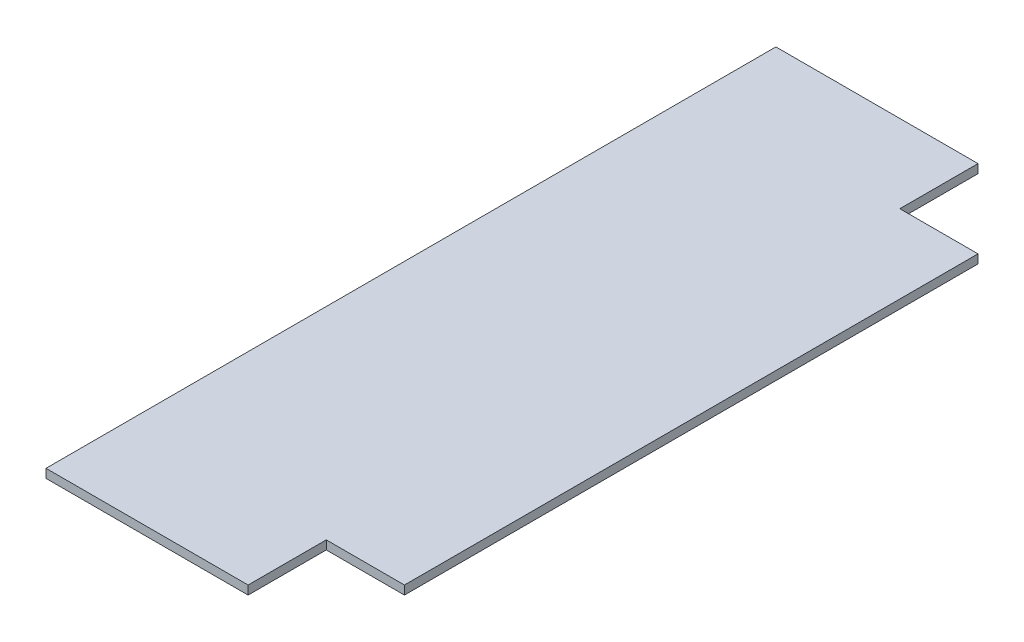
ISO-10303-21;
HEADER;
FILE_DESCRIPTION(('STEP AP214'),'2;1');
FILE_NAME('part.step','',(''),(''),'','','');
FILE_SCHEMA(('AUTOMOTIVE_DESIGN { 1 0 10303 214 1 1 1 1 }'));
ENDSEC;
DATA;
#1=APPLICATION_CONTEXT('core data for automotive mechanical design processes');
#2=APPLICATION_PROTOCOL_DEFINITION('international standard','automotive_design',2000,#1);
#3=PRODUCT_CONTEXT('',#1,'mechanical');
#4=PRODUCT('Part','Part','',(#3));
#5=PRODUCT_RELATED_PRODUCT_CATEGORY('part','',(#4));
#6=PRODUCT_DEFINITION_FORMATION('','',#4);
#7=PRODUCT_DEFINITION_CONTEXT('part definition',#1,'design');
#8=PRODUCT_DEFINITION('design','',#6,#7);
#9=PRODUCT_DEFINITION_SHAPE('','',#8);
#10=(LENGTH_UNIT() NAMED_UNIT(*) SI_UNIT(.MILLI.,.METRE.));
#11=(NAMED_UNIT(*) PLANE_ANGLE_UNIT() SI_UNIT($,.RADIAN.));
#12=(NAMED_UNIT(*) SI_UNIT($,.STERADIAN.) SOLID_ANGLE_UNIT());
#13=UNCERTAINTY_MEASURE_WITH_UNIT(LENGTH_MEASURE(1.E-05),#10,'distance_accuracy_value','');
#14=(GEOMETRIC_REPRESENTATION_CONTEXT(3) GLOBAL_UNCERTAINTY_ASSIGNED_CONTEXT((#13)) GLOBAL_UNIT_ASSIGNED_CONTEXT((#10,
#11,#12)) REPRESENTATION_CONTEXT('',''));
#15=CARTESIAN_POINT('',(0.,0.,0.));
#16=DIRECTION('',(0.,0.,1.));
#17=DIRECTION('',(1.,0.,0.));
#18=AXIS2_PLACEMENT_3D('',#15,#16,#17);
#19=CARTESIAN_POINT('',(0.,4.7625,0.));
#20=DIRECTION('',(1.,0.,0.));
#21=DIRECTION('',(0.,0.,-1.));
#22=AXIS2_PLACEMENT_3D('',#19,#20,#21);
#23=PLANE('',#22);
#24=DIRECTION('',(0.,0.,1.));
#25=VECTOR('',#24,1.);
#26=CARTESIAN_POINT('',(0.,0.,0.));
#27=LINE('',#26,#25);
#28=CARTESIAN_POINT('',(0.,0.,0.));
#29=VERTEX_POINT('',#28);
#30=CARTESIAN_POINT('',(0.,0.,396.875));
#31=VERTEX_POINT('',#30);
#32=EDGE_CURVE('E124',#29,#31,#27,.T.);
#33=ORIENTED_EDGE('',*,*,#32,.T.);
#34=DIRECTION('',(0.,-1.,0.));
#35=VECTOR('',#34,1.);
#36=CARTESIAN_POINT('',(0.,4.7625,396.875));
#37=LINE('',#36,#35);
#38=CARTESIAN_POINT('',(0.,4.7625,396.875));
#39=VERTEX_POINT('',#38);
#40=EDGE_CURVE('E11',#39,#31,#37,.T.);
#41=ORIENTED_EDGE('',*,*,#40,.F.);
#42=DIRECTION('',(0.,0.,1.));
#43=VECTOR('',#42,1.);
#44=CARTESIAN_POINT('',(0.,4.7625,0.));
#45=LINE('',#44,#43);
#46=CARTESIAN_POINT('',(0.,4.7625,0.));
#47=VERTEX_POINT('',#46);
#48=EDGE_CURVE('E125',#47,#39,#45,.T.);
#49=ORIENTED_EDGE('',*,*,#48,.F.);
#50=DIRECTION('',(0.,-1.,0.));
#51=VECTOR('',#50,1.);
#52=CARTESIAN_POINT('',(0.,4.7625,0.));
#53=LINE('',#52,#51);
#54=EDGE_CURVE('E46',#47,#29,#53,.T.);
#55=ORIENTED_EDGE('',*,*,#54,.T.);
#56=EDGE_LOOP('',(#33,#41,#49,#55));
#57=FACE_BOUND('',#56,.T.);
#58=ADVANCED_FACE('F39',(#57),#23,.F.);
#59=CARTESIAN_POINT('',(0.,4.7625,396.875));
#60=DIRECTION('',(0.,0.,-1.));
#61=DIRECTION('',(-1.,0.,0.));
#62=AXIS2_PLACEMENT_3D('',#59,#60,#61);
#63=PLANE('',#62);
#64=DIRECTION('',(1.,0.,0.));
#65=VECTOR('',#64,1.);
#66=CARTESIAN_POINT('',(0.,0.,396.875));
#67=LINE('',#66,#65);
#68=CARTESIAN_POINT('',(109.9,0.,396.875));
#69=VERTEX_POINT('',#68);
#70=EDGE_CURVE('E132',#31,#69,#67,.T.);
#71=ORIENTED_EDGE('',*,*,#70,.T.);
#72=DIRECTION('',(0.,1.,0.));
#73=VECTOR('',#72,1.);
#74=CARTESIAN_POINT('',(109.9,0.,396.875));
#75=LINE('',#74,#73);
#76=CARTESIAN_POINT('',(109.9,4.7625,396.875));
#77=VERTEX_POINT('',#76);
#78=EDGE_CURVE('E149',#69,#77,#75,.T.);
#79=ORIENTED_EDGE('',*,*,#78,.T.);
#80=DIRECTION('',(1.,0.,0.));
#81=VECTOR('',#80,1.);
#82=CARTESIAN_POINT('',(0.,4.7625,396.875));
#83=LINE('',#82,#81);
#84=EDGE_CURVE('E129',#39,#77,#83,.T.);
#85=ORIENTED_EDGE('',*,*,#84,.F.);
#86=ORIENTED_EDGE('',*,*,#40,.T.);
#87=EDGE_LOOP('',(#71,#79,#85,#86));
#88=FACE_BOUND('',#87,.T.);
#89=ADVANCED_FACE('F148',(#88),#63,.F.);
#90=CARTESIAN_POINT('',(152.4,4.7625,0.));
#91=DIRECTION('',(-1.,0.,0.));
#92=DIRECTION('',(0.,0.,1.));
#93=AXIS2_PLACEMENT_3D('',#90,#91,#92);
#94=PLANE('',#93);
#95=DIRECTION('',(0.,0.,-1.));
#96=VECTOR('',#95,1.);
#97=CARTESIAN_POINT('',(152.4,0.,0.));
#98=LINE('',#97,#96);
#99=CARTESIAN_POINT('',(152.4,0.,354.375));
#100=VERTEX_POINT('',#99);
#101=CARTESIAN_POINT('',(152.4,0.,42.5));
#102=VERTEX_POINT('',#101);
#103=EDGE_CURVE('E126',#100,#102,#98,.T.);
#104=ORIENTED_EDGE('',*,*,#103,.T.);
#105=DIRECTION('',(0.,1.,0.));
#106=VECTOR('',#105,1.);
#107=CARTESIAN_POINT('',(152.4,0.,42.5));
#108=LINE('',#107,#106);
#109=CARTESIAN_POINT('',(152.4,4.7625,42.5));
#110=VERTEX_POINT('',#109);
#111=EDGE_CURVE('E144',#102,#110,#108,.T.);
#112=ORIENTED_EDGE('',*,*,#111,.T.);
#113=DIRECTION('',(0.,0.,-1.));
#114=VECTOR('',#113,1.);
#115=CARTESIAN_POINT('',(152.4,4.7625,0.));
#116=LINE('',#115,#114);
#117=CARTESIAN_POINT('',(152.4,4.7625,354.375));
#118=VERTEX_POINT('',#117);
#119=EDGE_CURVE('E137',#118,#110,#116,.T.);
#120=ORIENTED_EDGE('',*,*,#119,.F.);
#121=DIRECTION('',(0.,1.,0.));
#122=VECTOR('',#121,1.);
#123=CARTESIAN_POINT('',(152.4,0.,354.375));
#124=LINE('',#123,#122);
#125=EDGE_CURVE('E155',#100,#118,#124,.T.);
#126=ORIENTED_EDGE('',*,*,#125,.F.);
#127=EDGE_LOOP('',(#104,#112,#120,#126));
#128=FACE_BOUND('',#127,.T.);
#129=ADVANCED_FACE('F172',(#128),#94,.F.);
#130=CARTESIAN_POINT('',(0.,4.7625,0.));
#131=DIRECTION('',(0.,0.,1.));
#132=DIRECTION('',(1.,0.,0.));
#133=AXIS2_PLACEMENT_3D('',#130,#131,#132);
#134=PLANE('',#133);
#135=DIRECTION('',(-1.,0.,0.));
#136=VECTOR('',#135,1.);
#137=CARTESIAN_POINT('',(0.,4.7625,0.));
#138=LINE('',#137,#136);
#139=CARTESIAN_POINT('',(109.9,4.7625,0.));
#140=VERTEX_POINT('',#139);
#141=EDGE_CURVE('E119',#140,#47,#138,.T.);
#142=ORIENTED_EDGE('',*,*,#141,.F.);
#143=DIRECTION('',(0.,1.,0.));
#144=VECTOR('',#143,1.);
#145=CARTESIAN_POINT('',(109.9,0.,0.));
#146=LINE('',#145,#144);
#147=CARTESIAN_POINT('',(109.9,0.,0.));
#148=VERTEX_POINT('',#147);
#149=EDGE_CURVE('E106',#148,#140,#146,.T.);
#150=ORIENTED_EDGE('',*,*,#149,.F.);
#151=DIRECTION('',(-1.,0.,0.));
#152=VECTOR('',#151,1.);
#153=CARTESIAN_POINT('',(0.,0.,0.));
#154=LINE('',#153,#152);
#155=EDGE_CURVE('E117',#148,#29,#154,.T.);
#156=ORIENTED_EDGE('',*,*,#155,.T.);
#157=ORIENTED_EDGE('',*,*,#54,.F.);
#158=EDGE_LOOP('',(#142,#150,#156,#157));
#159=FACE_BOUND('',#158,.T.);
#160=ADVANCED_FACE('F115',(#159),#134,.F.);
#161=CARTESIAN_POINT('',(0.,4.7625,0.));
#162=DIRECTION('',(0.,1.,0.));
#163=DIRECTION('',(0.,0.,1.));
#164=AXIS2_PLACEMENT_3D('',#161,#162,#163);
#165=PLANE('',#164);
#166=DIRECTION('',(1.,0.,0.));
#167=VECTOR('',#166,1.);
#168=CARTESIAN_POINT('',(152.4,4.7625,42.5));
#169=LINE('',#168,#167);
#170=CARTESIAN_POINT('',(109.9,4.7625,42.5));
#171=VERTEX_POINT('',#170);
#172=EDGE_CURVE('E111',#171,#110,#169,.T.);
#173=ORIENTED_EDGE('',*,*,#172,.F.);
#174=DIRECTION('',(0.,0.,1.));
#175=VECTOR('',#174,1.);
#176=CARTESIAN_POINT('',(109.9,4.7625,0.));
#177=LINE('',#176,#175);
#178=EDGE_CURVE('E199',#140,#171,#177,.T.);
#179=ORIENTED_EDGE('',*,*,#178,.F.);
#180=ORIENTED_EDGE('',*,*,#141,.T.);
#181=ORIENTED_EDGE('',*,*,#48,.T.);
#182=ORIENTED_EDGE('',*,*,#84,.T.);
#183=DIRECTION('',(0.,0.,1.));
#184=VECTOR('',#183,1.);
#185=CARTESIAN_POINT('',(109.9,4.7625,396.875));
#186=LINE('',#185,#184);
#187=CARTESIAN_POINT('',(109.9,4.7625,354.375));
#188=VERTEX_POINT('',#187);
#189=EDGE_CURVE('E157',#188,#77,#186,.T.);
#190=ORIENTED_EDGE('',*,*,#189,.F.);
#191=DIRECTION('',(-1.,0.,0.));
#192=VECTOR('',#191,1.);
#193=CARTESIAN_POINT('',(152.4,4.7625,354.375));
#194=LINE('',#193,#192);
#195=EDGE_CURVE('E162',#118,#188,#194,.T.);
#196=ORIENTED_EDGE('',*,*,#195,.F.);
#197=ORIENTED_EDGE('',*,*,#119,.T.);
#198=EDGE_LOOP('',(#173,#179,#180,#181,#182,#190,#196,#197));
#199=FACE_BOUND('',#198,.T.);
#200=ADVANCED_FACE('F166',(#199),#165,.T.);
#201=CARTESIAN_POINT('',(0.,0.,0.));
#202=DIRECTION('',(0.,1.,0.));
#203=DIRECTION('',(0.,0.,1.));
#204=AXIS2_PLACEMENT_3D('',#201,#202,#203);
#205=PLANE('',#204);
#206=DIRECTION('',(0.,0.,1.));
#207=VECTOR('',#206,1.);
#208=CARTESIAN_POINT('',(109.9,0.,0.));
#209=LINE('',#208,#207);
#210=CARTESIAN_POINT('',(109.9,0.,42.5));
#211=VERTEX_POINT('',#210);
#212=EDGE_CURVE('E102',#148,#211,#209,.T.);
#213=ORIENTED_EDGE('',*,*,#212,.T.);
#214=DIRECTION('',(1.,0.,0.));
#215=VECTOR('',#214,1.);
#216=CARTESIAN_POINT('',(152.4,0.,42.5));
#217=LINE('',#216,#215);
#218=EDGE_CURVE('E53',#211,#102,#217,.T.);
#219=ORIENTED_EDGE('',*,*,#218,.T.);
#220=ORIENTED_EDGE('',*,*,#103,.F.);
#221=DIRECTION('',(-1.,0.,0.));
#222=VECTOR('',#221,1.);
#223=CARTESIAN_POINT('',(152.4,0.,354.375));
#224=LINE('',#223,#222);
#225=CARTESIAN_POINT('',(109.9,0.,354.375));
#226=VERTEX_POINT('',#225);
#227=EDGE_CURVE('E154',#100,#226,#224,.T.);
#228=ORIENTED_EDGE('',*,*,#227,.T.);
#229=DIRECTION('',(0.,0.,1.));
#230=VECTOR('',#229,1.);
#231=CARTESIAN_POINT('',(109.9,0.,396.875));
#232=LINE('',#231,#230);
#233=EDGE_CURVE('E61',#226,#69,#232,.T.);
#234=ORIENTED_EDGE('',*,*,#233,.T.);
#235=ORIENTED_EDGE('',*,*,#70,.F.);
#236=ORIENTED_EDGE('',*,*,#32,.F.);
#237=ORIENTED_EDGE('',*,*,#155,.F.);
#238=EDGE_LOOP('',(#213,#219,#220,#228,#234,#235,#236,#237));
#239=FACE_BOUND('',#238,.T.);
#240=ADVANCED_FACE('F122',(#239),#205,.F.);
#241=CARTESIAN_POINT('',(109.9,0.,396.875));
#242=DIRECTION('',(-1.,0.,0.));
#243=DIRECTION('',(0.,0.,1.));
#244=AXIS2_PLACEMENT_3D('',#241,#242,#243);
#245=PLANE('',#244);
#246=ORIENTED_EDGE('',*,*,#189,.T.);
#247=ORIENTED_EDGE('',*,*,#78,.F.);
#248=ORIENTED_EDGE('',*,*,#233,.F.);
#249=DIRECTION('',(0.,1.,0.));
#250=VECTOR('',#249,1.);
#251=CARTESIAN_POINT('',(109.9,0.,354.375));
#252=LINE('',#251,#250);
#253=EDGE_CURVE('E159',#226,#188,#252,.T.);
#254=ORIENTED_EDGE('',*,*,#253,.T.);
#255=EDGE_LOOP('',(#246,#247,#248,#254));
#256=FACE_BOUND('',#255,.T.);
#257=ADVANCED_FACE('F183',(#256),#245,.F.);
#258=CARTESIAN_POINT('',(152.4,0.,354.375));
#259=DIRECTION('',(0.,0.,-1.));
#260=DIRECTION('',(-1.,0.,0.));
#261=AXIS2_PLACEMENT_3D('',#258,#259,#260);
#262=PLANE('',#261);
#263=ORIENTED_EDGE('',*,*,#195,.T.);
#264=ORIENTED_EDGE('',*,*,#253,.F.);
#265=ORIENTED_EDGE('',*,*,#227,.F.);
#266=ORIENTED_EDGE('',*,*,#125,.T.);
#267=EDGE_LOOP('',(#263,#264,#265,#266));
#268=FACE_BOUND('',#267,.T.);
#269=ADVANCED_FACE('F188',(#268),#262,.F.);
#270=CARTESIAN_POINT('',(152.4,0.,42.5));
#271=DIRECTION('',(0.,0.,1.));
#272=DIRECTION('',(1.,0.,0.));
#273=AXIS2_PLACEMENT_3D('',#270,#271,#272);
#274=PLANE('',#273);
#275=ORIENTED_EDGE('',*,*,#172,.T.);
#276=ORIENTED_EDGE('',*,*,#111,.F.);
#277=ORIENTED_EDGE('',*,*,#218,.F.);
#278=DIRECTION('',(0.,1.,0.));
#279=VECTOR('',#278,1.);
#280=CARTESIAN_POINT('',(109.9,0.,42.5));
#281=LINE('',#280,#279);
#282=EDGE_CURVE('E108',#211,#171,#281,.T.);
#283=ORIENTED_EDGE('',*,*,#282,.T.);
#284=EDGE_LOOP('',(#275,#276,#277,#283));
#285=FACE_BOUND('',#284,.T.);
#286=ADVANCED_FACE('F191',(#285),#274,.F.);
#287=CARTESIAN_POINT('',(109.9,0.,0.));
#288=DIRECTION('',(-1.,0.,0.));
#289=DIRECTION('',(0.,0.,1.));
#290=AXIS2_PLACEMENT_3D('',#287,#288,#289);
#291=PLANE('',#290);
#292=ORIENTED_EDGE('',*,*,#178,.T.);
#293=ORIENTED_EDGE('',*,*,#282,.F.);
#294=ORIENTED_EDGE('',*,*,#212,.F.);
#295=ORIENTED_EDGE('',*,*,#149,.T.);
#296=EDGE_LOOP('',(#292,#293,#294,#295));
#297=FACE_BOUND('',#296,.T.);
#298=ADVANCED_FACE('F105',(#297),#291,.F.);
#299=CLOSED_SHELL('',(#58,#89,#129,#160,#200,#240,#257,#269,#286,#298));
#300=MANIFOLD_SOLID_BREP('B2',#299);
#301=ADVANCED_BREP_SHAPE_REPRESENTATION('',(#18,#300),#14);
#302=SHAPE_DEFINITION_REPRESENTATION(#9,#301);
ENDSEC;
END-ISO-10303-21;
